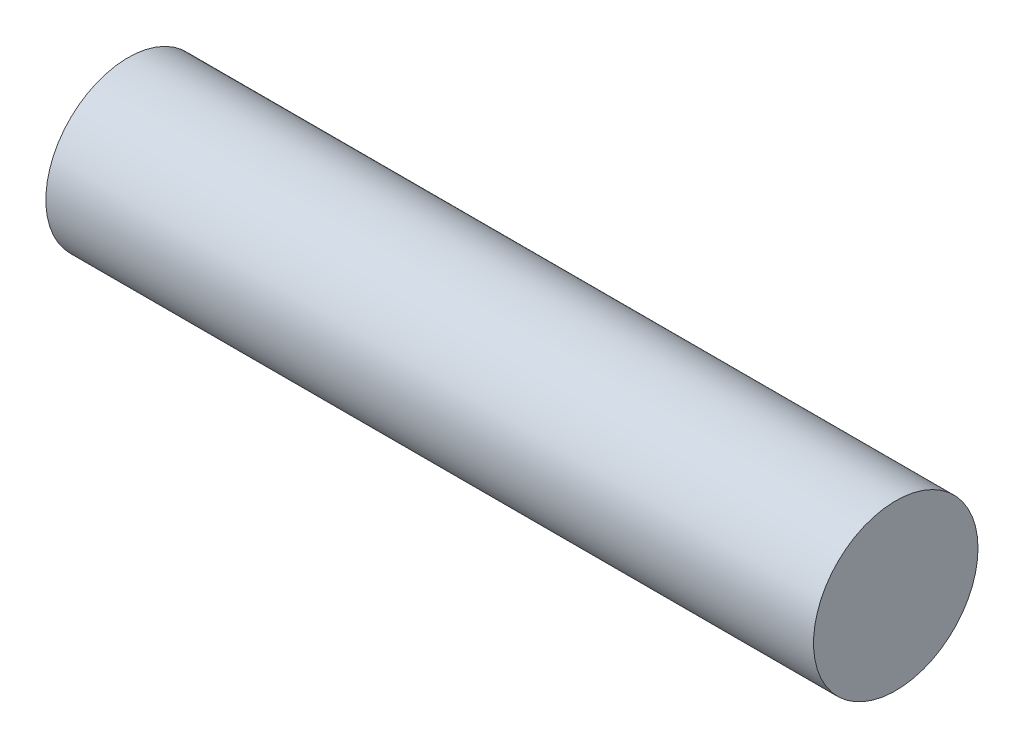
ISO-10303-21;
HEADER;
FILE_DESCRIPTION(('STEP AP214'),'2;1');
FILE_NAME('part.step','',(''),(''),'','','');
FILE_SCHEMA(('AUTOMOTIVE_DESIGN { 1 0 10303 214 1 1 1 1 }'));
ENDSEC;
DATA;
#1=APPLICATION_CONTEXT('core data for automotive mechanical design processes');
#2=APPLICATION_PROTOCOL_DEFINITION('international standard','automotive_design',2000,#1);
#3=PRODUCT_CONTEXT('',#1,'mechanical');
#4=PRODUCT('Part','Part','',(#3));
#5=PRODUCT_RELATED_PRODUCT_CATEGORY('part','',(#4));
#6=PRODUCT_DEFINITION_FORMATION('','',#4);
#7=PRODUCT_DEFINITION_CONTEXT('part definition',#1,'design');
#8=PRODUCT_DEFINITION('design','',#6,#7);
#9=PRODUCT_DEFINITION_SHAPE('','',#8);
#10=(LENGTH_UNIT() NAMED_UNIT(*) SI_UNIT(.MILLI.,.METRE.));
#11=(NAMED_UNIT(*) PLANE_ANGLE_UNIT() SI_UNIT($,.RADIAN.));
#12=(NAMED_UNIT(*) SI_UNIT($,.STERADIAN.) SOLID_ANGLE_UNIT());
#13=UNCERTAINTY_MEASURE_WITH_UNIT(LENGTH_MEASURE(1.E-05),#10,'distance_accuracy_value','');
#14=(GEOMETRIC_REPRESENTATION_CONTEXT(3) GLOBAL_UNCERTAINTY_ASSIGNED_CONTEXT((#13)) GLOBAL_UNIT_ASSIGNED_CONTEXT((#10,
#11,#12)) REPRESENTATION_CONTEXT('',''));
#15=CARTESIAN_POINT('',(0.,0.,0.));
#16=DIRECTION('',(0.,0.,1.));
#17=DIRECTION('',(1.,0.,0.));
#18=AXIS2_PLACEMENT_3D('',#15,#16,#17);
#19=CARTESIAN_POINT('',(21.,0.,0.));
#20=DIRECTION('',(-1.,0.,0.));
#21=DIRECTION('',(0.,0.,1.));
#22=AXIS2_PLACEMENT_3D('',#19,#20,#21);
#23=CYLINDRICAL_SURFACE('',#22,2.25);
#24=CARTESIAN_POINT('',(21.,0.,0.));
#25=DIRECTION('',(1.,0.,0.));
#26=DIRECTION('',(0.,0.,-1.));
#27=AXIS2_PLACEMENT_3D('',#24,#25,#26);
#28=CIRCLE('',#27,2.25);
#29=CARTESIAN_POINT('',(21.,0.,-2.25));
#30=VERTEX_POINT('',#29);
#31=EDGE_CURVE('E10',#30,#30,#28,.T.);
#32=ORIENTED_EDGE('',*,*,#31,.F.);
#33=EDGE_LOOP('',(#32));
#34=FACE_BOUND('',#33,.T.);
#35=CARTESIAN_POINT('',(0.,0.,0.));
#36=DIRECTION('',(1.,0.,0.));
#37=DIRECTION('',(0.,0.,-1.));
#38=AXIS2_PLACEMENT_3D('',#35,#36,#37);
#39=CIRCLE('',#38,2.25);
#40=CARTESIAN_POINT('',(0.,0.,-2.25));
#41=VERTEX_POINT('',#40);
#42=EDGE_CURVE('E35',#41,#41,#39,.T.);
#43=ORIENTED_EDGE('',*,*,#42,.T.);
#44=EDGE_LOOP('',(#43));
#45=FACE_BOUND('',#44,.T.);
#46=ADVANCED_FACE('F32',(#34,#45),#23,.T.);
#47=CARTESIAN_POINT('',(21.,0.,0.));
#48=DIRECTION('',(1.,0.,0.));
#49=DIRECTION('',(0.,0.,-1.));
#50=AXIS2_PLACEMENT_3D('',#47,#48,#49);
#51=PLANE('',#50);
#52=ORIENTED_EDGE('',*,*,#31,.T.);
#53=EDGE_LOOP('',(#52));
#54=FACE_BOUND('',#53,.T.);
#55=ADVANCED_FACE('F47',(#54),#51,.T.);
#56=CARTESIAN_POINT('',(0.,0.,0.));
#57=DIRECTION('',(1.,0.,0.));
#58=DIRECTION('',(0.,0.,-1.));
#59=AXIS2_PLACEMENT_3D('',#56,#57,#58);
#60=PLANE('',#59);
#61=ORIENTED_EDGE('',*,*,#42,.F.);
#62=EDGE_LOOP('',(#61));
#63=FACE_BOUND('',#62,.T.);
#64=ADVANCED_FACE('F45',(#63),#60,.F.);
#65=CLOSED_SHELL('',(#46,#55,#64));
#66=MANIFOLD_SOLID_BREP('B2',#65);
#67=ADVANCED_BREP_SHAPE_REPRESENTATION('',(#18,#66),#14);
#68=SHAPE_DEFINITION_REPRESENTATION(#9,#67);
ENDSEC;
END-ISO-10303-21;
